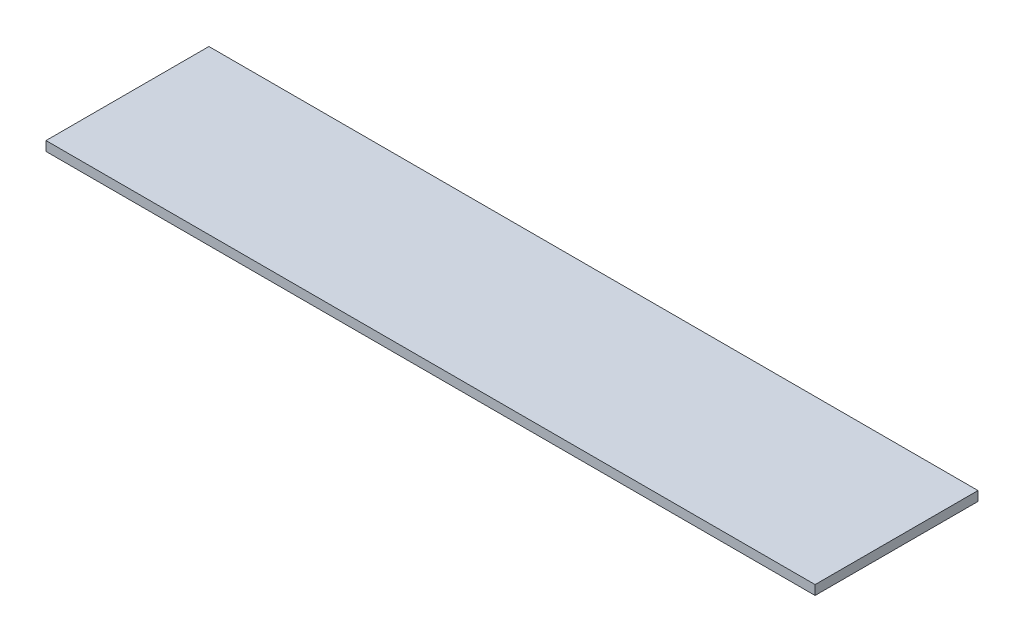
ISO-10303-21;
HEADER;
FILE_DESCRIPTION(('STEP AP214'),'2;1');
FILE_NAME('part.step','',(''),(''),'','','');
FILE_SCHEMA(('AUTOMOTIVE_DESIGN { 1 0 10303 214 1 1 1 1 }'));
ENDSEC;
DATA;
#1=APPLICATION_CONTEXT('core data for automotive mechanical design processes');
#2=APPLICATION_PROTOCOL_DEFINITION('international standard','automotive_design',2000,#1);
#3=PRODUCT_CONTEXT('',#1,'mechanical');
#4=PRODUCT('Part','Part','',(#3));
#5=PRODUCT_RELATED_PRODUCT_CATEGORY('part','',(#4));
#6=PRODUCT_DEFINITION_FORMATION('','',#4);
#7=PRODUCT_DEFINITION_CONTEXT('part definition',#1,'design');
#8=PRODUCT_DEFINITION('design','',#6,#7);
#9=PRODUCT_DEFINITION_SHAPE('','',#8);
#10=(LENGTH_UNIT() NAMED_UNIT(*) SI_UNIT(.MILLI.,.METRE.));
#11=(NAMED_UNIT(*) PLANE_ANGLE_UNIT() SI_UNIT($,.RADIAN.));
#12=(NAMED_UNIT(*) SI_UNIT($,.STERADIAN.) SOLID_ANGLE_UNIT());
#13=UNCERTAINTY_MEASURE_WITH_UNIT(LENGTH_MEASURE(1.E-05),#10,'distance_accuracy_value','');
#14=(GEOMETRIC_REPRESENTATION_CONTEXT(3) GLOBAL_UNCERTAINTY_ASSIGNED_CONTEXT((#13)) GLOBAL_UNIT_ASSIGNED_CONTEXT((#10,
#11,#12)) REPRESENTATION_CONTEXT('',''));
#15=CARTESIAN_POINT('',(0.,0.,0.));
#16=DIRECTION('',(0.,0.,1.));
#17=DIRECTION('',(1.,0.,0.));
#18=AXIS2_PLACEMENT_3D('',#15,#16,#17);
#19=CARTESIAN_POINT('',(203.,5.,43.));
#20=DIRECTION('',(-1.,0.,0.));
#21=DIRECTION('',(0.,0.,1.));
#22=AXIS2_PLACEMENT_3D('',#19,#20,#21);
#23=PLANE('',#22);
#24=DIRECTION('',(0.,0.,-1.));
#25=VECTOR('',#24,1.);
#26=CARTESIAN_POINT('',(203.,0.,43.));
#27=LINE('',#26,#25);
#28=CARTESIAN_POINT('',(203.,0.,43.));
#29=VERTEX_POINT('',#28);
#30=CARTESIAN_POINT('',(203.,0.,-43.));
#31=VERTEX_POINT('',#30);
#32=EDGE_CURVE('E100',#29,#31,#27,.T.);
#33=ORIENTED_EDGE('',*,*,#32,.T.);
#34=DIRECTION('',(0.,-1.,0.));
#35=VECTOR('',#34,1.);
#36=CARTESIAN_POINT('',(203.,5.,-43.));
#37=LINE('',#36,#35);
#38=CARTESIAN_POINT('',(203.,5.,-43.));
#39=VERTEX_POINT('',#38);
#40=EDGE_CURVE('E11',#39,#31,#37,.T.);
#41=ORIENTED_EDGE('',*,*,#40,.F.);
#42=DIRECTION('',(0.,0.,-1.));
#43=VECTOR('',#42,1.);
#44=CARTESIAN_POINT('',(203.,5.,43.));
#45=LINE('',#44,#43);
#46=CARTESIAN_POINT('',(203.,5.,43.));
#47=VERTEX_POINT('',#46);
#48=EDGE_CURVE('E88',#47,#39,#45,.T.);
#49=ORIENTED_EDGE('',*,*,#48,.F.);
#50=DIRECTION('',(0.,-1.,0.));
#51=VECTOR('',#50,1.);
#52=CARTESIAN_POINT('',(203.,5.,43.));
#53=LINE('',#52,#51);
#54=EDGE_CURVE('E96',#47,#29,#53,.T.);
#55=ORIENTED_EDGE('',*,*,#54,.T.);
#56=EDGE_LOOP('',(#33,#41,#49,#55));
#57=FACE_BOUND('',#56,.T.);
#58=ADVANCED_FACE('F37',(#57),#23,.F.);
#59=CARTESIAN_POINT('',(-203.,5.,-43.));
#60=DIRECTION('',(0.,0.,1.));
#61=DIRECTION('',(1.,0.,0.));
#62=AXIS2_PLACEMENT_3D('',#59,#60,#61);
#63=PLANE('',#62);
#64=DIRECTION('',(-1.,0.,0.));
#65=VECTOR('',#64,1.);
#66=CARTESIAN_POINT('',(-203.,0.,-43.));
#67=LINE('',#66,#65);
#68=CARTESIAN_POINT('',(-203.,0.,-43.));
#69=VERTEX_POINT('',#68);
#70=EDGE_CURVE('E92',#31,#69,#67,.T.);
#71=ORIENTED_EDGE('',*,*,#70,.T.);
#72=DIRECTION('',(0.,-1.,0.));
#73=VECTOR('',#72,1.);
#74=CARTESIAN_POINT('',(-203.,5.,-43.));
#75=LINE('',#74,#73);
#76=CARTESIAN_POINT('',(-203.,5.,-43.));
#77=VERTEX_POINT('',#76);
#78=EDGE_CURVE('E45',#77,#69,#75,.T.);
#79=ORIENTED_EDGE('',*,*,#78,.F.);
#80=DIRECTION('',(-1.,0.,0.));
#81=VECTOR('',#80,1.);
#82=CARTESIAN_POINT('',(-203.,5.,-43.));
#83=LINE('',#82,#81);
#84=EDGE_CURVE('E83',#39,#77,#83,.T.);
#85=ORIENTED_EDGE('',*,*,#84,.F.);
#86=ORIENTED_EDGE('',*,*,#40,.T.);
#87=EDGE_LOOP('',(#71,#79,#85,#86));
#88=FACE_BOUND('',#87,.T.);
#89=ADVANCED_FACE('F91',(#88),#63,.F.);
#90=CARTESIAN_POINT('',(-203.,5.,43.));
#91=DIRECTION('',(1.,0.,0.));
#92=DIRECTION('',(0.,0.,-1.));
#93=AXIS2_PLACEMENT_3D('',#90,#91,#92);
#94=PLANE('',#93);
#95=DIRECTION('',(0.,0.,1.));
#96=VECTOR('',#95,1.);
#97=CARTESIAN_POINT('',(-203.,0.,43.));
#98=LINE('',#97,#96);
#99=CARTESIAN_POINT('',(-203.,0.,43.));
#100=VERTEX_POINT('',#99);
#101=EDGE_CURVE('E70',#69,#100,#98,.T.);
#102=ORIENTED_EDGE('',*,*,#101,.T.);
#103=DIRECTION('',(0.,-1.,0.));
#104=VECTOR('',#103,1.);
#105=CARTESIAN_POINT('',(-203.,5.,43.));
#106=LINE('',#105,#104);
#107=CARTESIAN_POINT('',(-203.,5.,43.));
#108=VERTEX_POINT('',#107);
#109=EDGE_CURVE('E93',#108,#100,#106,.T.);
#110=ORIENTED_EDGE('',*,*,#109,.F.);
#111=DIRECTION('',(0.,0.,1.));
#112=VECTOR('',#111,1.);
#113=CARTESIAN_POINT('',(-203.,5.,43.));
#114=LINE('',#113,#112);
#115=EDGE_CURVE('E86',#77,#108,#114,.T.);
#116=ORIENTED_EDGE('',*,*,#115,.F.);
#117=ORIENTED_EDGE('',*,*,#78,.T.);
#118=EDGE_LOOP('',(#102,#110,#116,#117));
#119=FACE_BOUND('',#118,.T.);
#120=ADVANCED_FACE('F94',(#119),#94,.F.);
#121=CARTESIAN_POINT('',(-203.,5.,43.));
#122=DIRECTION('',(0.,0.,-1.));
#123=DIRECTION('',(-1.,0.,0.));
#124=AXIS2_PLACEMENT_3D('',#121,#122,#123);
#125=PLANE('',#124);
#126=DIRECTION('',(1.,0.,0.));
#127=VECTOR('',#126,1.);
#128=CARTESIAN_POINT('',(-203.,0.,43.));
#129=LINE('',#128,#127);
#130=EDGE_CURVE('E76',#100,#29,#129,.T.);
#131=ORIENTED_EDGE('',*,*,#130,.T.);
#132=ORIENTED_EDGE('',*,*,#54,.F.);
#133=DIRECTION('',(1.,0.,0.));
#134=VECTOR('',#133,1.);
#135=CARTESIAN_POINT('',(-203.,5.,43.));
#136=LINE('',#135,#134);
#137=EDGE_CURVE('E53',#108,#47,#136,.T.);
#138=ORIENTED_EDGE('',*,*,#137,.F.);
#139=ORIENTED_EDGE('',*,*,#109,.T.);
#140=EDGE_LOOP('',(#131,#132,#138,#139));
#141=FACE_BOUND('',#140,.T.);
#142=ADVANCED_FACE('F107',(#141),#125,.F.);
#143=CARTESIAN_POINT('',(0.,5.,0.));
#144=DIRECTION('',(0.,-1.,0.));
#145=DIRECTION('',(0.,0.,-1.));
#146=AXIS2_PLACEMENT_3D('',#143,#144,#145);
#147=PLANE('',#146);
#148=ORIENTED_EDGE('',*,*,#48,.T.);
#149=ORIENTED_EDGE('',*,*,#84,.T.);
#150=ORIENTED_EDGE('',*,*,#115,.T.);
#151=ORIENTED_EDGE('',*,*,#137,.T.);
#152=EDGE_LOOP('',(#148,#149,#150,#151));
#153=FACE_BOUND('',#152,.T.);
#154=ADVANCED_FACE('F84',(#153),#147,.F.);
#155=CARTESIAN_POINT('',(0.,0.,0.));
#156=DIRECTION('',(0.,-1.,0.));
#157=DIRECTION('',(0.,0.,-1.));
#158=AXIS2_PLACEMENT_3D('',#155,#156,#157);
#159=PLANE('',#158);
#160=ORIENTED_EDGE('',*,*,#32,.F.);
#161=ORIENTED_EDGE('',*,*,#130,.F.);
#162=ORIENTED_EDGE('',*,*,#101,.F.);
#163=ORIENTED_EDGE('',*,*,#70,.F.);
#164=EDGE_LOOP('',(#160,#161,#162,#163));
#165=FACE_BOUND('',#164,.T.);
#166=ADVANCED_FACE('F110',(#165),#159,.T.);
#167=CLOSED_SHELL('',(#58,#89,#120,#142,#154,#166));
#168=MANIFOLD_SOLID_BREP('B2',#167);
#169=ADVANCED_BREP_SHAPE_REPRESENTATION('',(#18,#168),#14);
#170=SHAPE_DEFINITION_REPRESENTATION(#9,#169);
ENDSEC;
END-ISO-10303-21;
